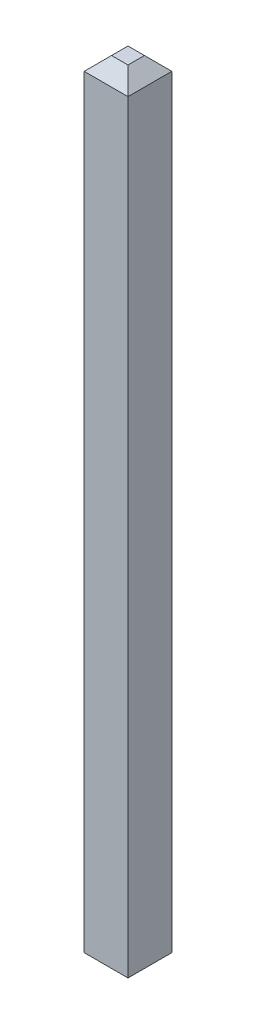
ISO-10303-21;
HEADER;
FILE_DESCRIPTION(('STEP AP214'),'2;1');
FILE_NAME('part.step','',(''),(''),'','','');
FILE_SCHEMA(('AUTOMOTIVE_DESIGN { 1 0 10303 214 1 1 1 1 }'));
ENDSEC;
DATA;
#1=APPLICATION_CONTEXT('core data for automotive mechanical design processes');
#2=APPLICATION_PROTOCOL_DEFINITION('international standard','automotive_design',2000,#1);
#3=PRODUCT_CONTEXT('',#1,'mechanical');
#4=PRODUCT('Part','Part','',(#3));
#5=PRODUCT_RELATED_PRODUCT_CATEGORY('part','',(#4));
#6=PRODUCT_DEFINITION_FORMATION('','',#4);
#7=PRODUCT_DEFINITION_CONTEXT('part definition',#1,'design');
#8=PRODUCT_DEFINITION('design','',#6,#7);
#9=PRODUCT_DEFINITION_SHAPE('','',#8);
#10=(LENGTH_UNIT() NAMED_UNIT(*) SI_UNIT(.MILLI.,.METRE.));
#11=(NAMED_UNIT(*) PLANE_ANGLE_UNIT() SI_UNIT($,.RADIAN.));
#12=(NAMED_UNIT(*) SI_UNIT($,.STERADIAN.) SOLID_ANGLE_UNIT());
#13=UNCERTAINTY_MEASURE_WITH_UNIT(LENGTH_MEASURE(1.E-05),#10,'distance_accuracy_value','');
#14=(GEOMETRIC_REPRESENTATION_CONTEXT(3) GLOBAL_UNCERTAINTY_ASSIGNED_CONTEXT((#13)) GLOBAL_UNIT_ASSIGNED_CONTEXT((#10,
#11,#12)) REPRESENTATION_CONTEXT('',''));
#15=CARTESIAN_POINT('',(0.,0.,0.));
#16=DIRECTION('',(0.,0.,1.));
#17=DIRECTION('',(1.,0.,0.));
#18=AXIS2_PLACEMENT_3D('',#15,#16,#17);
#19=CARTESIAN_POINT('',(1.59,7.07,-0.32));
#20=DIRECTION('',(-0.707106781186548,-0.707106781186548,0.));
#21=DIRECTION('',(-0.707106781186548,0.707106781186548,0.));
#22=AXIS2_PLACEMENT_3D('',#19,#20,#21);
#23=PLANE('',#22);
#24=DIRECTION('',(0.577350269189626,-0.577350269189626,0.577350269189626));
#25=VECTOR('',#24,1.);
#26=CARTESIAN_POINT('',(1.376666666667,7.283333333333,0.106666666667));
#27=LINE('',#26,#25);
#28=CARTESIAN_POINT('',(1.39,7.27,0.12));
#29=VERTEX_POINT('',#28);
#30=CARTESIAN_POINT('',(1.59,7.07,0.32));
#31=VERTEX_POINT('',#30);
#32=EDGE_CURVE('E192',#29,#31,#27,.T.);
#33=ORIENTED_EDGE('',*,*,#32,.T.);
#34=DIRECTION('',(0.,0.,1.));
#35=VECTOR('',#34,1.);
#36=CARTESIAN_POINT('',(1.59,7.07,-0.32));
#37=LINE('',#36,#35);
#38=CARTESIAN_POINT('',(1.59,7.07,-0.32));
#39=VERTEX_POINT('',#38);
#40=EDGE_CURVE('E172',#39,#31,#37,.T.);
#41=ORIENTED_EDGE('',*,*,#40,.F.);
#42=DIRECTION('',(0.577350269189626,-0.577350269189626,-0.577350269189626));
#43=VECTOR('',#42,1.);
#44=CARTESIAN_POINT('',(1.59,7.07,-0.32));
#45=LINE('',#44,#43);
#46=CARTESIAN_POINT('',(1.39,7.27,-0.12));
#47=VERTEX_POINT('',#46);
#48=EDGE_CURVE('E11',#47,#39,#45,.T.);
#49=ORIENTED_EDGE('',*,*,#48,.F.);
#50=DIRECTION('',(0.,0.,-1.));
#51=VECTOR('',#50,1.);
#52=CARTESIAN_POINT('',(1.39,7.27,-0.32));
#53=LINE('',#52,#51);
#54=EDGE_CURVE('E175',#29,#47,#53,.T.);
#55=ORIENTED_EDGE('',*,*,#54,.F.);
#56=EDGE_LOOP('',(#33,#41,#49,#55));
#57=FACE_BOUND('',#56,.T.);
#58=ADVANCED_FACE('F16',(#57),#23,.F.);
#59=CARTESIAN_POINT('',(1.27,7.07,-0.32));
#60=DIRECTION('',(0.,0.707106781186548,-0.707106781186548));
#61=DIRECTION('',(-1.,0.,0.));
#62=AXIS2_PLACEMENT_3D('',#59,#60,#61);
#63=PLANE('',#62);
#64=DIRECTION('',(0.577350269189626,0.577350269189626,0.577350269189626));
#65=VECTOR('',#64,1.);
#66=CARTESIAN_POINT('',(1.083333333333,7.203333333333,-0.186666666667));
#67=LINE('',#66,#65);
#68=CARTESIAN_POINT('',(0.95,7.07,-0.32));
#69=VERTEX_POINT('',#68);
#70=CARTESIAN_POINT('',(1.15,7.27,-0.12));
#71=VERTEX_POINT('',#70);
#72=EDGE_CURVE('E27',#69,#71,#67,.T.);
#73=ORIENTED_EDGE('',*,*,#72,.T.);
#74=DIRECTION('',(-1.,0.,0.));
#75=VECTOR('',#74,1.);
#76=CARTESIAN_POINT('',(0.95,7.27,-0.12));
#77=LINE('',#76,#75);
#78=EDGE_CURVE('E189',#47,#71,#77,.T.);
#79=ORIENTED_EDGE('',*,*,#78,.F.);
#80=ORIENTED_EDGE('',*,*,#48,.T.);
#81=DIRECTION('',(1.,0.,0.));
#82=VECTOR('',#81,1.);
#83=CARTESIAN_POINT('',(1.59,7.07,-0.32));
#84=LINE('',#83,#82);
#85=EDGE_CURVE('E115',#69,#39,#84,.T.);
#86=ORIENTED_EDGE('',*,*,#85,.F.);
#87=EDGE_LOOP('',(#73,#79,#80,#86));
#88=FACE_BOUND('',#87,.T.);
#89=ADVANCED_FACE('F18',(#88),#63,.T.);
#90=CARTESIAN_POINT('',(1.15,7.27,-0.32));
#91=DIRECTION('',(0.707106781186548,-0.707106781186548,0.));
#92=DIRECTION('',(0.,0.,-1.));
#93=AXIS2_PLACEMENT_3D('',#90,#91,#92);
#94=PLANE('',#93);
#95=DIRECTION('',(-0.577350269189626,-0.577350269189626,0.577350269189626));
#96=VECTOR('',#95,1.);
#97=CARTESIAN_POINT('',(1.083333333333,7.203333333333,0.186666666667));
#98=LINE('',#97,#96);
#99=CARTESIAN_POINT('',(1.15,7.27,0.12));
#100=VERTEX_POINT('',#99);
#101=CARTESIAN_POINT('',(0.95,7.07,0.32));
#102=VERTEX_POINT('',#101);
#103=EDGE_CURVE('E41',#100,#102,#98,.T.);
#104=ORIENTED_EDGE('',*,*,#103,.F.);
#105=DIRECTION('',(0.,0.,1.));
#106=VECTOR('',#105,1.);
#107=CARTESIAN_POINT('',(1.15,7.27,-0.32));
#108=LINE('',#107,#106);
#109=EDGE_CURVE('E20',#71,#100,#108,.T.);
#110=ORIENTED_EDGE('',*,*,#109,.F.);
#111=ORIENTED_EDGE('',*,*,#72,.F.);
#112=DIRECTION('',(0.,0.,-1.));
#113=VECTOR('',#112,1.);
#114=CARTESIAN_POINT('',(0.95,7.07,-0.32));
#115=LINE('',#114,#113);
#116=EDGE_CURVE('E104',#102,#69,#115,.T.);
#117=ORIENTED_EDGE('',*,*,#116,.F.);
#118=EDGE_LOOP('',(#104,#110,#111,#117));
#119=FACE_BOUND('',#118,.T.);
#120=ADVANCED_FACE('F237',(#119),#94,.F.);
#121=CARTESIAN_POINT('',(0.95,7.27,0.12));
#122=DIRECTION('',(0.,-0.707106781186548,-0.707106781186548));
#123=DIRECTION('',(0.,-0.707106781186548,0.707106781186548));
#124=AXIS2_PLACEMENT_3D('',#121,#122,#123);
#125=PLANE('',#124);
#126=ORIENTED_EDGE('',*,*,#32,.F.);
#127=DIRECTION('',(1.,0.,0.));
#128=VECTOR('',#127,1.);
#129=CARTESIAN_POINT('',(0.95,7.27,0.12));
#130=LINE('',#129,#128);
#131=EDGE_CURVE('E196',#100,#29,#130,.T.);
#132=ORIENTED_EDGE('',*,*,#131,.F.);
#133=ORIENTED_EDGE('',*,*,#103,.T.);
#134=DIRECTION('',(-1.,0.,0.));
#135=VECTOR('',#134,1.);
#136=CARTESIAN_POINT('',(1.27,7.07,0.32));
#137=LINE('',#136,#135);
#138=EDGE_CURVE('E176',#31,#102,#137,.T.);
#139=ORIENTED_EDGE('',*,*,#138,.F.);
#140=EDGE_LOOP('',(#126,#132,#133,#139));
#141=FACE_BOUND('',#140,.T.);
#142=ADVANCED_FACE('F213',(#141),#125,.F.);
#143=CARTESIAN_POINT('',(0.95,7.27,-0.32));
#144=DIRECTION('',(0.,-1.,0.));
#145=DIRECTION('',(0.,0.,-1.));
#146=AXIS2_PLACEMENT_3D('',#143,#144,#145);
#147=PLANE('',#146);
#148=ORIENTED_EDGE('',*,*,#54,.T.);
#149=ORIENTED_EDGE('',*,*,#78,.T.);
#150=ORIENTED_EDGE('',*,*,#109,.T.);
#151=ORIENTED_EDGE('',*,*,#131,.T.);
#152=EDGE_LOOP('',(#148,#149,#150,#151));
#153=FACE_BOUND('',#152,.T.);
#154=ADVANCED_FACE('F235',(#153),#147,.F.);
#155=CARTESIAN_POINT('',(1.59,7.27,-0.32));
#156=DIRECTION('',(-1.,0.,0.));
#157=DIRECTION('',(0.,1.,0.));
#158=AXIS2_PLACEMENT_3D('',#155,#156,#157);
#159=PLANE('',#158);
#160=DIRECTION('',(0.,-1.,0.));
#161=VECTOR('',#160,1.);
#162=CARTESIAN_POINT('',(1.59,7.27,-0.32));
#163=LINE('',#162,#161);
#164=CARTESIAN_POINT('',(1.59,-4.07,-0.32));
#165=VERTEX_POINT('',#164);
#166=EDGE_CURVE('E122',#39,#165,#163,.T.);
#167=ORIENTED_EDGE('',*,*,#166,.F.);
#168=ORIENTED_EDGE('',*,*,#40,.T.);
#169=DIRECTION('',(0.,-1.,0.));
#170=VECTOR('',#169,1.);
#171=CARTESIAN_POINT('',(1.59,7.27,0.32));
#172=LINE('',#171,#170);
#173=CARTESIAN_POINT('',(1.59,-4.07,0.32));
#174=VERTEX_POINT('',#173);
#175=EDGE_CURVE('E178',#31,#174,#172,.T.);
#176=ORIENTED_EDGE('',*,*,#175,.T.);
#177=DIRECTION('',(0.,0.,-1.));
#178=VECTOR('',#177,1.);
#179=CARTESIAN_POINT('',(1.59,-4.07,-0.32));
#180=LINE('',#179,#178);
#181=EDGE_CURVE('E146',#174,#165,#180,.T.);
#182=ORIENTED_EDGE('',*,*,#181,.T.);
#183=EDGE_LOOP('',(#167,#168,#176,#182));
#184=FACE_BOUND('',#183,.T.);
#185=ADVANCED_FACE('F211',(#184),#159,.F.);
#186=CARTESIAN_POINT('',(1.27,1.5,0.32));
#187=DIRECTION('',(0.,0.,-1.));
#188=DIRECTION('',(0.,-1.,0.));
#189=AXIS2_PLACEMENT_3D('',#186,#187,#188);
#190=PLANE('',#189);
#191=ORIENTED_EDGE('',*,*,#175,.F.);
#192=ORIENTED_EDGE('',*,*,#138,.T.);
#193=DIRECTION('',(0.,1.,0.));
#194=VECTOR('',#193,1.);
#195=CARTESIAN_POINT('',(0.95,-4.27,0.32));
#196=LINE('',#195,#194);
#197=CARTESIAN_POINT('',(0.95,-4.07,0.32));
#198=VERTEX_POINT('',#197);
#199=EDGE_CURVE('E169',#198,#102,#196,.T.);
#200=ORIENTED_EDGE('',*,*,#199,.F.);
#201=DIRECTION('',(1.,0.,0.));
#202=VECTOR('',#201,1.);
#203=CARTESIAN_POINT('',(1.27,-4.07,0.32));
#204=LINE('',#203,#202);
#205=EDGE_CURVE('E142',#198,#174,#204,.T.);
#206=ORIENTED_EDGE('',*,*,#205,.T.);
#207=EDGE_LOOP('',(#191,#192,#200,#206));
#208=FACE_BOUND('',#207,.T.);
#209=ADVANCED_FACE('F215',(#208),#190,.F.);
#210=CARTESIAN_POINT('',(1.39,-4.27,-0.32));
#211=DIRECTION('',(-0.707106781186548,0.707106781186548,0.));
#212=DIRECTION('',(0.,0.,1.));
#213=AXIS2_PLACEMENT_3D('',#210,#211,#212);
#214=PLANE('',#213);
#215=DIRECTION('',(-0.577350269189626,-0.577350269189626,0.577350269189626));
#216=VECTOR('',#215,1.);
#217=CARTESIAN_POINT('',(1.456666666667,-4.203333333333,-0.186666666667));
#218=LINE('',#217,#216);
#219=CARTESIAN_POINT('',(1.39,-4.27,-0.12));
#220=VERTEX_POINT('',#219);
#221=EDGE_CURVE('E116',#165,#220,#218,.T.);
#222=ORIENTED_EDGE('',*,*,#221,.F.);
#223=ORIENTED_EDGE('',*,*,#181,.F.);
#224=DIRECTION('',(-0.577350269189626,-0.577350269189626,-0.577350269189626));
#225=VECTOR('',#224,1.);
#226=CARTESIAN_POINT('',(1.243333333333,-4.416666666667,-0.02666666666667));
#227=LINE('',#226,#225);
#228=CARTESIAN_POINT('',(1.39,-4.27,0.12));
#229=VERTEX_POINT('',#228);
#230=EDGE_CURVE('E147',#174,#229,#227,.T.);
#231=ORIENTED_EDGE('',*,*,#230,.T.);
#232=DIRECTION('',(0.,0.,1.));
#233=VECTOR('',#232,1.);
#234=CARTESIAN_POINT('',(1.39,-4.27,-0.32));
#235=LINE('',#234,#233);
#236=EDGE_CURVE('E168',#220,#229,#235,.T.);
#237=ORIENTED_EDGE('',*,*,#236,.F.);
#238=EDGE_LOOP('',(#222,#223,#231,#237));
#239=FACE_BOUND('',#238,.T.);
#240=ADVANCED_FACE('F267',(#239),#214,.F.);
#241=CARTESIAN_POINT('',(1.59,-4.27,0.12));
#242=DIRECTION('',(0.,0.707106781186548,-0.707106781186548));
#243=DIRECTION('',(-1.,0.,0.));
#244=AXIS2_PLACEMENT_3D('',#241,#242,#243);
#245=PLANE('',#244);
#246=ORIENTED_EDGE('',*,*,#230,.F.);
#247=ORIENTED_EDGE('',*,*,#205,.F.);
#248=DIRECTION('',(-0.577350269189626,0.577350269189626,0.577350269189626));
#249=VECTOR('',#248,1.);
#250=CARTESIAN_POINT('',(1.163333333333,-4.283333333333,0.106666666667));
#251=LINE('',#250,#249);
#252=CARTESIAN_POINT('',(1.15,-4.27,0.12));
#253=VERTEX_POINT('',#252);
#254=EDGE_CURVE('E99',#253,#198,#251,.T.);
#255=ORIENTED_EDGE('',*,*,#254,.F.);
#256=DIRECTION('',(-1.,0.,0.));
#257=VECTOR('',#256,1.);
#258=CARTESIAN_POINT('',(1.59,-4.27,0.12));
#259=LINE('',#258,#257);
#260=EDGE_CURVE('E141',#229,#253,#259,.T.);
#261=ORIENTED_EDGE('',*,*,#260,.F.);
#262=EDGE_LOOP('',(#246,#247,#255,#261));
#263=FACE_BOUND('',#262,.T.);
#264=ADVANCED_FACE('F218',(#263),#245,.F.);
#265=CARTESIAN_POINT('',(0.95,-4.07,-0.32));
#266=DIRECTION('',(0.707106781186548,0.707106781186548,0.));
#267=DIRECTION('',(0.,0.,-1.));
#268=AXIS2_PLACEMENT_3D('',#265,#266,#267);
#269=PLANE('',#268);
#270=DIRECTION('',(0.577350269189626,-0.577350269189626,0.577350269189626));
#271=VECTOR('',#270,1.);
#272=CARTESIAN_POINT('',(1.056666666667,-4.176666666667,-0.213333333333));
#273=LINE('',#272,#271);
#274=CARTESIAN_POINT('',(0.95,-4.07,-0.32));
#275=VERTEX_POINT('',#274);
#276=CARTESIAN_POINT('',(1.15,-4.27,-0.12));
#277=VERTEX_POINT('',#276);
#278=EDGE_CURVE('E97',#275,#277,#273,.T.);
#279=ORIENTED_EDGE('',*,*,#278,.T.);
#280=DIRECTION('',(0.,0.,-1.));
#281=VECTOR('',#280,1.);
#282=CARTESIAN_POINT('',(1.15,-4.27,-0.32));
#283=LINE('',#282,#281);
#284=EDGE_CURVE('E135',#253,#277,#283,.T.);
#285=ORIENTED_EDGE('',*,*,#284,.F.);
#286=ORIENTED_EDGE('',*,*,#254,.T.);
#287=DIRECTION('',(0.,0.,1.));
#288=VECTOR('',#287,1.);
#289=CARTESIAN_POINT('',(0.95,-4.07,-0.32));
#290=LINE('',#289,#288);
#291=EDGE_CURVE('E92',#275,#198,#290,.T.);
#292=ORIENTED_EDGE('',*,*,#291,.F.);
#293=EDGE_LOOP('',(#279,#285,#286,#292));
#294=FACE_BOUND('',#293,.T.);
#295=ADVANCED_FACE('F94',(#294),#269,.F.);
#296=CARTESIAN_POINT('',(0.95,-4.27,-0.32));
#297=DIRECTION('',(1.,0.,0.));
#298=DIRECTION('',(0.,0.,1.));
#299=AXIS2_PLACEMENT_3D('',#296,#297,#298);
#300=PLANE('',#299);
#301=ORIENTED_EDGE('',*,*,#199,.T.);
#302=ORIENTED_EDGE('',*,*,#116,.T.);
#303=DIRECTION('',(0.,1.,0.));
#304=VECTOR('',#303,1.);
#305=CARTESIAN_POINT('',(0.95,-4.27,-0.32));
#306=LINE('',#305,#304);
#307=EDGE_CURVE('E108',#275,#69,#306,.T.);
#308=ORIENTED_EDGE('',*,*,#307,.F.);
#309=ORIENTED_EDGE('',*,*,#291,.T.);
#310=EDGE_LOOP('',(#301,#302,#308,#309));
#311=FACE_BOUND('',#310,.T.);
#312=ADVANCED_FACE('F110',(#311),#300,.F.);
#313=CARTESIAN_POINT('',(1.27,1.5,-0.32));
#314=DIRECTION('',(0.,0.,-1.));
#315=DIRECTION('',(0.,-1.,0.));
#316=AXIS2_PLACEMENT_3D('',#313,#314,#315);
#317=PLANE('',#316);
#318=ORIENTED_EDGE('',*,*,#307,.T.);
#319=ORIENTED_EDGE('',*,*,#85,.T.);
#320=ORIENTED_EDGE('',*,*,#166,.T.);
#321=DIRECTION('',(-1.,0.,0.));
#322=VECTOR('',#321,1.);
#323=CARTESIAN_POINT('',(0.95,-4.07,-0.32));
#324=LINE('',#323,#322);
#325=EDGE_CURVE('E119',#165,#275,#324,.T.);
#326=ORIENTED_EDGE('',*,*,#325,.T.);
#327=EDGE_LOOP('',(#318,#319,#320,#326));
#328=FACE_BOUND('',#327,.T.);
#329=ADVANCED_FACE('F120',(#328),#317,.T.);
#330=CARTESIAN_POINT('',(1.27,-4.07,-0.32));
#331=DIRECTION('',(0.,-0.707106781186548,-0.707106781186548));
#332=DIRECTION('',(0.,-0.707106781186548,0.707106781186548));
#333=AXIS2_PLACEMENT_3D('',#330,#331,#332);
#334=PLANE('',#333);
#335=ORIENTED_EDGE('',*,*,#278,.F.);
#336=ORIENTED_EDGE('',*,*,#325,.F.);
#337=ORIENTED_EDGE('',*,*,#221,.T.);
#338=DIRECTION('',(1.,0.,0.));
#339=VECTOR('',#338,1.);
#340=CARTESIAN_POINT('',(1.59,-4.27,-0.12));
#341=LINE('',#340,#339);
#342=EDGE_CURVE('E129',#277,#220,#341,.T.);
#343=ORIENTED_EDGE('',*,*,#342,.F.);
#344=EDGE_LOOP('',(#335,#336,#337,#343));
#345=FACE_BOUND('',#344,.T.);
#346=ADVANCED_FACE('F127',(#345),#334,.T.);
#347=CARTESIAN_POINT('',(1.59,-4.27,-0.32));
#348=DIRECTION('',(0.,1.,0.));
#349=DIRECTION('',(0.,0.,-1.));
#350=AXIS2_PLACEMENT_3D('',#347,#348,#349);
#351=PLANE('',#350);
#352=ORIENTED_EDGE('',*,*,#236,.T.);
#353=ORIENTED_EDGE('',*,*,#260,.T.);
#354=ORIENTED_EDGE('',*,*,#284,.T.);
#355=ORIENTED_EDGE('',*,*,#342,.T.);
#356=EDGE_LOOP('',(#352,#353,#354,#355));
#357=FACE_BOUND('',#356,.T.);
#358=ADVANCED_FACE('F222',(#357),#351,.F.);
#359=CLOSED_SHELL('',(#58,#89,#120,#142,#154,#185,#209,#240,#264,#295,#312,#329,#346,#358));
#360=MANIFOLD_SOLID_BREP('B1',#359);
#361=ADVANCED_BREP_SHAPE_REPRESENTATION('',(#18,#360),#14);
#362=SHAPE_DEFINITION_REPRESENTATION(#9,#361);
ENDSEC;
END-ISO-10303-21;
